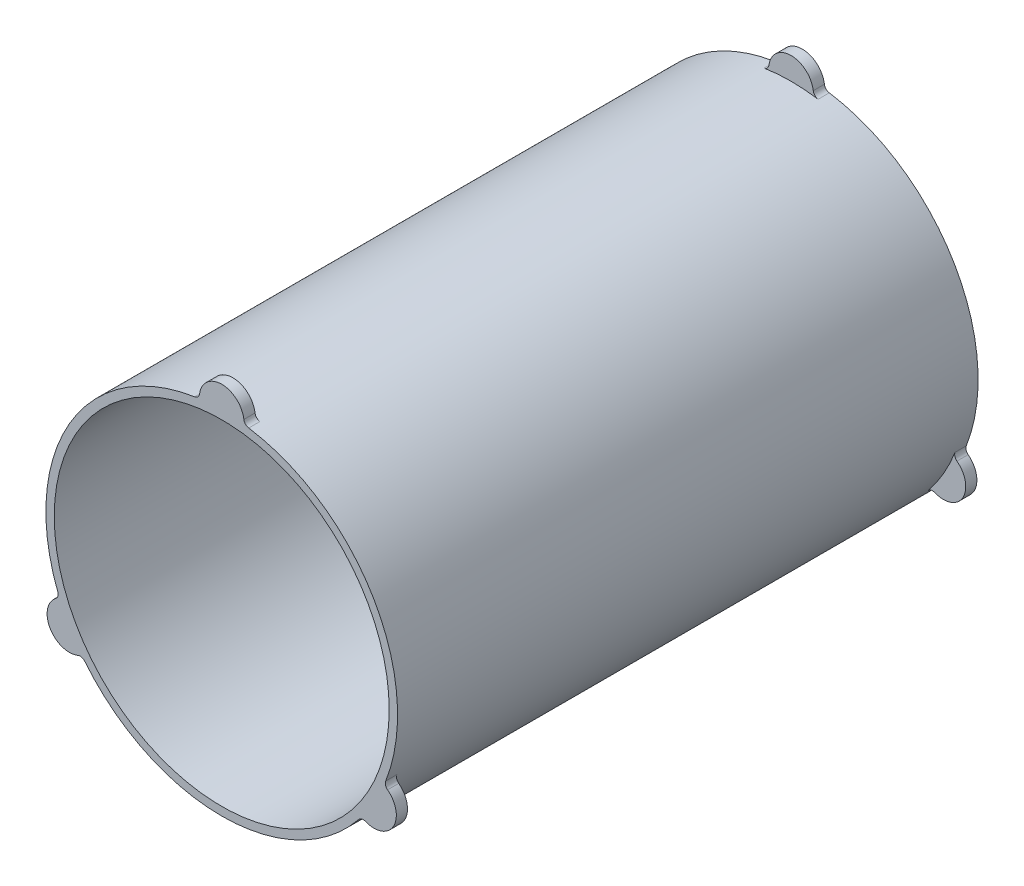
ISO-10303-21;
HEADER;
FILE_DESCRIPTION(('STEP AP214'),'2;1');
FILE_NAME('part.step','',(''),(''),'','','');
FILE_SCHEMA(('AUTOMOTIVE_DESIGN { 1 0 10303 214 1 1 1 1 }'));
ENDSEC;
DATA;
#1=APPLICATION_CONTEXT('core data for automotive mechanical design processes');
#2=APPLICATION_PROTOCOL_DEFINITION('international standard','automotive_design',2000,#1);
#3=PRODUCT_CONTEXT('',#1,'mechanical');
#4=PRODUCT('Part','Part','',(#3));
#5=PRODUCT_RELATED_PRODUCT_CATEGORY('part','',(#4));
#6=PRODUCT_DEFINITION_FORMATION('','',#4);
#7=PRODUCT_DEFINITION_CONTEXT('part definition',#1,'design');
#8=PRODUCT_DEFINITION('design','',#6,#7);
#9=PRODUCT_DEFINITION_SHAPE('','',#8);
#10=(LENGTH_UNIT() NAMED_UNIT(*) SI_UNIT(.MILLI.,.METRE.));
#11=(NAMED_UNIT(*) PLANE_ANGLE_UNIT() SI_UNIT($,.RADIAN.));
#12=(NAMED_UNIT(*) SI_UNIT($,.STERADIAN.) SOLID_ANGLE_UNIT());
#13=UNCERTAINTY_MEASURE_WITH_UNIT(LENGTH_MEASURE(1.E-05),#10,'distance_accuracy_value','');
#14=(GEOMETRIC_REPRESENTATION_CONTEXT(3) GLOBAL_UNCERTAINTY_ASSIGNED_CONTEXT((#13)) GLOBAL_UNIT_ASSIGNED_CONTEXT((#10,
#11,#12)) REPRESENTATION_CONTEXT('',''));
#15=CARTESIAN_POINT('',(0.,0.,0.));
#16=DIRECTION('',(0.,0.,1.));
#17=DIRECTION('',(1.,0.,0.));
#18=AXIS2_PLACEMENT_3D('',#15,#16,#17);
#19=CARTESIAN_POINT('',(0.,0.,165.1));
#20=DIRECTION('',(0.,0.,-1.));
#21=DIRECTION('',(-1.,0.,0.));
#22=AXIS2_PLACEMENT_3D('',#19,#20,#21);
#23=CYLINDRICAL_SURFACE('',#22,100.0125);
#24=CARTESIAN_POINT('',(0.,0.,165.1));
#25=DIRECTION('',(0.,0.,1.));
#26=DIRECTION('',(1.,0.,0.));
#27=AXIS2_PLACEMENT_3D('',#24,#25,#26);
#28=CIRCLE('',#27,100.0125);
#29=CARTESIAN_POINT('',(93.2656496084759,-36.1111999158017,165.1));
#30=VERTEX_POINT('',#29);
#31=CARTESIAN_POINT('',(15.3596083160143,98.8260218192993,165.1));
#32=VERTEX_POINT('',#31);
#33=EDGE_CURVE('E206',#30,#32,#28,.T.);
#34=ORIENTED_EDGE('',*,*,#33,.F.);
#35=DIRECTION('',(0.,0.,-1.));
#36=VECTOR('',#35,1.);
#37=CARTESIAN_POINT('',(93.2656496084759,-36.1111999158017,165.1));
#38=LINE('',#37,#36);
#39=CARTESIAN_POINT('',(93.2656496084759,-36.1111999158017,158.75));
#40=VERTEX_POINT('',#39);
#41=EDGE_CURVE('E274',#30,#40,#38,.T.);
#42=ORIENTED_EDGE('',*,*,#41,.T.);
#43=CARTESIAN_POINT('',(0.,0.,158.75));
#44=DIRECTION('',(0.,0.,-1.));
#45=DIRECTION('',(-0.499999999999992,-0.866025403784443,0.));
#46=AXIS2_PLACEMENT_3D('',#43,#44,#45);
#47=CIRCLE('',#46,100.0125);
#48=CARTESIAN_POINT('',(77.9060412924619,-62.714821903496,158.75));
#49=VERTEX_POINT('',#48);
#50=EDGE_CURVE('E381',#40,#49,#47,.T.);
#51=ORIENTED_EDGE('',*,*,#50,.T.);
#52=DIRECTION('',(0.,0.,-1.));
#53=VECTOR('',#52,1.);
#54=CARTESIAN_POINT('',(77.9060412924619,-62.714821903496,165.1));
#55=LINE('',#54,#53);
#56=CARTESIAN_POINT('',(77.9060412924619,-62.714821903496,165.1));
#57=VERTEX_POINT('',#56);
#58=EDGE_CURVE('E271',#49,#57,#55,.F.);
#59=ORIENTED_EDGE('',*,*,#58,.T.);
#60=CARTESIAN_POINT('',(-77.906041292461,-62.7148219034971,165.1));
#61=VERTEX_POINT('',#60);
#62=EDGE_CURVE('E233',#61,#57,#28,.T.);
#63=ORIENTED_EDGE('',*,*,#62,.F.);
#64=DIRECTION('',(0.,0.,-1.));
#65=VECTOR('',#64,1.);
#66=CARTESIAN_POINT('',(-77.906041292461,-62.7148219034971,165.1));
#67=LINE('',#66,#65);
#68=CARTESIAN_POINT('',(-77.906041292461,-62.7148219034971,158.75));
#69=VERTEX_POINT('',#68);
#70=EDGE_CURVE('E254',#61,#69,#67,.T.);
#71=ORIENTED_EDGE('',*,*,#70,.T.);
#72=CARTESIAN_POINT('',(0.,0.,158.75));
#73=DIRECTION('',(0.,0.,-1.));
#74=DIRECTION('',(-0.500000000000004,0.866025403784436,0.));
#75=AXIS2_PLACEMENT_3D('',#72,#73,#74);
#76=CIRCLE('',#75,100.0125);
#77=CARTESIAN_POINT('',(-93.2656496084754,-36.111199915803,158.75));
#78=VERTEX_POINT('',#77);
#79=EDGE_CURVE('E389',#69,#78,#76,.T.);
#80=ORIENTED_EDGE('',*,*,#79,.T.);
#81=DIRECTION('',(0.,0.,-1.));
#82=VECTOR('',#81,1.);
#83=CARTESIAN_POINT('',(-93.2656496084754,-36.111199915803,165.1));
#84=LINE('',#83,#82);
#85=CARTESIAN_POINT('',(-93.2656496084754,-36.111199915803,165.1));
#86=VERTEX_POINT('',#85);
#87=EDGE_CURVE('E251',#78,#86,#84,.F.);
#88=ORIENTED_EDGE('',*,*,#87,.T.);
#89=CARTESIAN_POINT('',(-15.3596083160142,98.8260218192993,165.1));
#90=VERTEX_POINT('',#89);
#91=EDGE_CURVE('E228',#90,#86,#28,.T.);
#92=ORIENTED_EDGE('',*,*,#91,.F.);
#93=DIRECTION('',(0.,0.,-1.));
#94=VECTOR('',#93,1.);
#95=CARTESIAN_POINT('',(-15.3596083160143,98.8260218192993,165.1));
#96=LINE('',#95,#94);
#97=CARTESIAN_POINT('',(-15.3596083160143,98.8260218192994,158.75));
#98=VERTEX_POINT('',#97);
#99=EDGE_CURVE('E239',#90,#98,#96,.T.);
#100=ORIENTED_EDGE('',*,*,#99,.T.);
#101=CARTESIAN_POINT('',(0.,0.,158.75));
#102=DIRECTION('',(0.,0.,-1.));
#103=DIRECTION('',(1.,0.,0.));
#104=AXIS2_PLACEMENT_3D('',#101,#102,#103);
#105=CIRCLE('',#104,100.0125);
#106=CARTESIAN_POINT('',(15.3596083160143,98.8260218192994,158.75));
#107=VERTEX_POINT('',#106);
#108=EDGE_CURVE('E222',#98,#107,#105,.T.);
#109=ORIENTED_EDGE('',*,*,#108,.T.);
#110=DIRECTION('',(0.,0.,-1.));
#111=VECTOR('',#110,1.);
#112=CARTESIAN_POINT('',(15.3596083160143,98.8260218192993,165.1));
#113=LINE('',#112,#111);
#114=EDGE_CURVE('E230',#107,#32,#113,.F.);
#115=ORIENTED_EDGE('',*,*,#114,.T.);
#116=EDGE_LOOP('',(#34,#42,#51,#59,#63,#71,#80,#88,#92,#100,#109,#115));
#117=FACE_BOUND('',#116,.T.);
#118=CARTESIAN_POINT('',(0.,0.,-165.1));
#119=DIRECTION('',(0.,0.,1.));
#120=DIRECTION('',(1.,0.,0.));
#121=AXIS2_PLACEMENT_3D('',#118,#119,#120);
#122=CIRCLE('',#121,100.0125);
#123=CARTESIAN_POINT('',(-77.906041292461,-62.7148219034971,-165.1));
#124=VERTEX_POINT('',#123);
#125=CARTESIAN_POINT('',(77.9060412924619,-62.714821903496,-165.1));
#126=VERTEX_POINT('',#125);
#127=EDGE_CURVE('E473',#124,#126,#122,.T.);
#128=ORIENTED_EDGE('',*,*,#127,.T.);
#129=DIRECTION('',(0.,0.,-1.));
#130=VECTOR('',#129,1.);
#131=CARTESIAN_POINT('',(77.9060412924619,-62.714821903496,165.1));
#132=LINE('',#131,#130);
#133=CARTESIAN_POINT('',(77.9060412924619,-62.714821903496,-158.75));
#134=VERTEX_POINT('',#133);
#135=EDGE_CURVE('E334',#126,#134,#132,.F.);
#136=ORIENTED_EDGE('',*,*,#135,.T.);
#137=CARTESIAN_POINT('',(0.,0.,-158.75));
#138=DIRECTION('',(0.,0.,-1.));
#139=DIRECTION('',(-0.499999999999992,-0.866025403784443,0.));
#140=AXIS2_PLACEMENT_3D('',#137,#138,#139);
#141=CIRCLE('',#140,100.0125);
#142=CARTESIAN_POINT('',(93.2656496084759,-36.1111999158017,-158.75));
#143=VERTEX_POINT('',#142);
#144=EDGE_CURVE('E56',#143,#134,#141,.T.);
#145=ORIENTED_EDGE('',*,*,#144,.F.);
#146=DIRECTION('',(0.,0.,-1.));
#147=VECTOR('',#146,1.);
#148=CARTESIAN_POINT('',(93.2656496084759,-36.1111999158017,165.1));
#149=LINE('',#148,#147);
#150=CARTESIAN_POINT('',(93.2656496084759,-36.1111999158017,-165.1));
#151=VERTEX_POINT('',#150);
#152=EDGE_CURVE('E332',#143,#151,#149,.T.);
#153=ORIENTED_EDGE('',*,*,#152,.T.);
#154=CARTESIAN_POINT('',(15.3596083160143,98.8260218192993,-165.1));
#155=VERTEX_POINT('',#154);
#156=EDGE_CURVE('E347',#151,#155,#122,.T.);
#157=ORIENTED_EDGE('',*,*,#156,.T.);
#158=DIRECTION('',(0.,0.,-1.));
#159=VECTOR('',#158,1.);
#160=CARTESIAN_POINT('',(15.3596083160143,98.8260218192993,165.1));
#161=LINE('',#160,#159);
#162=CARTESIAN_POINT('',(15.3596083160143,98.8260218192994,-158.75));
#163=VERTEX_POINT('',#162);
#164=EDGE_CURVE('E294',#155,#163,#161,.F.);
#165=ORIENTED_EDGE('',*,*,#164,.T.);
#166=CARTESIAN_POINT('',(0.,0.,-158.75));
#167=DIRECTION('',(0.,0.,-1.));
#168=DIRECTION('',(1.,0.,0.));
#169=AXIS2_PLACEMENT_3D('',#166,#167,#168);
#170=CIRCLE('',#169,100.0125);
#171=CARTESIAN_POINT('',(-15.3596083160143,98.8260218192994,-158.75));
#172=VERTEX_POINT('',#171);
#173=EDGE_CURVE('E373',#172,#163,#170,.T.);
#174=ORIENTED_EDGE('',*,*,#173,.F.);
#175=DIRECTION('',(0.,0.,-1.));
#176=VECTOR('',#175,1.);
#177=CARTESIAN_POINT('',(-15.3596083160143,98.8260218192993,165.1));
#178=LINE('',#177,#176);
#179=CARTESIAN_POINT('',(-15.3596083160143,98.8260218192993,-165.1));
#180=VERTEX_POINT('',#179);
#181=EDGE_CURVE('E291',#172,#180,#178,.T.);
#182=ORIENTED_EDGE('',*,*,#181,.T.);
#183=CARTESIAN_POINT('',(-93.2656496084754,-36.111199915803,-165.1));
#184=VERTEX_POINT('',#183);
#185=EDGE_CURVE('E236',#180,#184,#122,.T.);
#186=ORIENTED_EDGE('',*,*,#185,.T.);
#187=DIRECTION('',(0.,0.,-1.));
#188=VECTOR('',#187,1.);
#189=CARTESIAN_POINT('',(-93.2656496084754,-36.111199915803,165.1));
#190=LINE('',#189,#188);
#191=CARTESIAN_POINT('',(-93.2656496084754,-36.111199915803,-158.75));
#192=VERTEX_POINT('',#191);
#193=EDGE_CURVE('E315',#184,#192,#190,.F.);
#194=ORIENTED_EDGE('',*,*,#193,.T.);
#195=CARTESIAN_POINT('',(0.,0.,-158.75));
#196=DIRECTION('',(0.,0.,-1.));
#197=DIRECTION('',(-0.500000000000004,0.866025403784436,0.));
#198=AXIS2_PLACEMENT_3D('',#195,#196,#197);
#199=CIRCLE('',#198,100.0125);
#200=CARTESIAN_POINT('',(-77.906041292461,-62.7148219034971,-158.75));
#201=VERTEX_POINT('',#200);
#202=EDGE_CURVE('E364',#201,#192,#199,.T.);
#203=ORIENTED_EDGE('',*,*,#202,.F.);
#204=DIRECTION('',(0.,0.,-1.));
#205=VECTOR('',#204,1.);
#206=CARTESIAN_POINT('',(-77.906041292461,-62.7148219034971,165.1));
#207=LINE('',#206,#205);
#208=EDGE_CURVE('E312',#201,#124,#207,.T.);
#209=ORIENTED_EDGE('',*,*,#208,.T.);
#210=EDGE_LOOP('',(#128,#136,#145,#153,#157,#165,#174,#182,#186,#194,#203,#209));
#211=FACE_BOUND('',#210,.T.);
#212=ADVANCED_FACE('F42',(#117,#211),#23,.T.);
#213=CARTESIAN_POINT('',(0.,0.,165.1));
#214=DIRECTION('',(0.,0.,1.));
#215=DIRECTION('',(1.,0.,0.));
#216=AXIS2_PLACEMENT_3D('',#213,#214,#215);
#217=PLANE('',#216);
#218=CARTESIAN_POINT('',(0.,100.0125,165.1));
#219=DIRECTION('',(0.,0.,1.));
#220=DIRECTION('',(-1.,0.,0.));
#221=AXIS2_PLACEMENT_3D('',#218,#219,#220);
#222=CIRCLE('',#221,12.7);
#223=CARTESIAN_POINT('',(12.5926342807534,101.660396195515,165.1));
#224=VERTEX_POINT('',#223);
#225=CARTESIAN_POINT('',(-12.5926342807534,101.660396195515,165.1));
#226=VERTEX_POINT('',#225);
#227=EDGE_CURVE('E204',#224,#226,#222,.T.);
#228=ORIENTED_EDGE('',*,*,#227,.T.);
#229=CARTESIAN_POINT('',(-15.8667191937493,102.088849206349,165.1));
#230=DIRECTION('',(0.,0.,1.));
#231=DIRECTION('',(1.,0.,0.));
#232=AXIS2_PLACEMENT_3D('',#229,#230,#231);
#233=CIRCLE('',#232,3.302);
#234=EDGE_CURVE('E242',#226,#90,#233,.F.);
#235=ORIENTED_EDGE('',*,*,#234,.T.);
#236=ORIENTED_EDGE('',*,*,#91,.T.);
#237=CARTESIAN_POINT('',(-96.3448964526918,-37.303442706674,165.1));
#238=DIRECTION('',(0.,0.,1.));
#239=DIRECTION('',(1.,0.,0.));
#240=AXIS2_PLACEMENT_3D('',#237,#238,#239);
#241=CIRCLE('',#240,3.302);
#242=CARTESIAN_POINT('',(-94.3368028044836,-39.9246569100588,165.1));
#243=VERTEX_POINT('',#242);
#244=EDGE_CURVE('E261',#86,#243,#241,.F.);
#245=ORIENTED_EDGE('',*,*,#244,.T.);
#246=CARTESIAN_POINT('',(-86.613365695991,-50.0062500000004,165.1));
#247=DIRECTION('',(0.,0.,1.));
#248=DIRECTION('',(0.500000000000004,-0.866025403784436,0.));
#249=AXIS2_PLACEMENT_3D('',#246,#247,#248);
#250=CIRCLE('',#249,12.7);
#251=CARTESIAN_POINT('',(-81.7441685237301,-61.7357392854573,165.1));
#252=VERTEX_POINT('',#251);
#253=EDGE_CURVE('E386',#243,#252,#250,.T.);
#254=ORIENTED_EDGE('',*,*,#253,.T.);
#255=CARTESIAN_POINT('',(-80.4781772589423,-64.785406499676,165.1));
#256=DIRECTION('',(0.,0.,1.));
#257=DIRECTION('',(1.,0.,0.));
#258=AXIS2_PLACEMENT_3D('',#255,#256,#257);
#259=CIRCLE('',#258,3.302);
#260=EDGE_CURVE('E257',#252,#61,#259,.F.);
#261=ORIENTED_EDGE('',*,*,#260,.T.);
#262=ORIENTED_EDGE('',*,*,#62,.T.);
#263=CARTESIAN_POINT('',(80.4781772589432,-64.785406499675,165.1));
#264=DIRECTION('',(0.,0.,1.));
#265=DIRECTION('',(1.,0.,0.));
#266=AXIS2_PLACEMENT_3D('',#263,#264,#265);
#267=CIRCLE('',#266,3.302);
#268=CARTESIAN_POINT('',(81.744168523731,-61.7357392854561,165.1));
#269=VERTEX_POINT('',#268);
#270=EDGE_CURVE('E281',#57,#269,#267,.F.);
#271=ORIENTED_EDGE('',*,*,#270,.T.);
#272=CARTESIAN_POINT('',(86.6133656959916,-50.0062499999992,165.1));
#273=DIRECTION('',(0.,0.,1.));
#274=DIRECTION('',(0.499999999999992,0.866025403784443,0.));
#275=AXIS2_PLACEMENT_3D('',#272,#273,#274);
#276=CIRCLE('',#275,12.7);
#277=CARTESIAN_POINT('',(94.3368028044842,-39.9246569100575,165.1));
#278=VERTEX_POINT('',#277);
#279=EDGE_CURVE('E378',#269,#278,#276,.T.);
#280=ORIENTED_EDGE('',*,*,#279,.T.);
#281=CARTESIAN_POINT('',(96.3448964526923,-37.3034427066727,165.1));
#282=DIRECTION('',(0.,0.,1.));
#283=DIRECTION('',(1.,0.,0.));
#284=AXIS2_PLACEMENT_3D('',#281,#282,#283);
#285=CIRCLE('',#284,3.302);
#286=EDGE_CURVE('E277',#278,#30,#285,.F.);
#287=ORIENTED_EDGE('',*,*,#286,.T.);
#288=ORIENTED_EDGE('',*,*,#33,.T.);
#289=CARTESIAN_POINT('',(15.8667191937494,102.088849206349,165.1));
#290=DIRECTION('',(0.,0.,1.));
#291=DIRECTION('',(1.,0.,0.));
#292=AXIS2_PLACEMENT_3D('',#289,#290,#291);
#293=CIRCLE('',#292,3.302);
#294=EDGE_CURVE('E200',#32,#224,#293,.F.);
#295=ORIENTED_EDGE('',*,*,#294,.T.);
#296=EDGE_LOOP('',(#228,#235,#236,#245,#254,#261,#262,#271,#280,#287,#288,#295));
#297=FACE_BOUND('',#296,.T.);
#298=CARTESIAN_POINT('',(0.,0.,165.1));
#299=DIRECTION('',(0.,0.,1.));
#300=DIRECTION('',(1.,0.,0.));
#301=AXIS2_PLACEMENT_3D('',#298,#299,#300);
#302=CIRCLE('',#301,95.25);
#303=CARTESIAN_POINT('',(95.25,0.,165.1));
#304=VERTEX_POINT('',#303);
#305=EDGE_CURVE('E399',#304,#304,#302,.T.);
#306=ORIENTED_EDGE('',*,*,#305,.F.);
#307=EDGE_LOOP('',(#306));
#308=FACE_BOUND('',#307,.T.);
#309=ADVANCED_FACE('F202',(#297,#308),#217,.T.);
#310=CARTESIAN_POINT('',(0.,0.,-165.1));
#311=DIRECTION('',(0.,0.,1.));
#312=DIRECTION('',(1.,0.,0.));
#313=AXIS2_PLACEMENT_3D('',#310,#311,#312);
#314=PLANE('',#313);
#315=ORIENTED_EDGE('',*,*,#185,.F.);
#316=CARTESIAN_POINT('',(-15.8667191937494,102.088849206349,-165.1));
#317=DIRECTION('',(0.,0.,1.));
#318=DIRECTION('',(1.,0.,0.));
#319=AXIS2_PLACEMENT_3D('',#316,#317,#318);
#320=CIRCLE('',#319,3.302);
#321=CARTESIAN_POINT('',(-12.5926342807534,101.660396195515,-165.1));
#322=VERTEX_POINT('',#321);
#323=EDGE_CURVE('E302',#180,#322,#320,.T.);
#324=ORIENTED_EDGE('',*,*,#323,.T.);
#325=CARTESIAN_POINT('',(0.,100.0125,-165.1));
#326=DIRECTION('',(0.,0.,1.));
#327=DIRECTION('',(-1.,0.,0.));
#328=AXIS2_PLACEMENT_3D('',#325,#326,#327);
#329=CIRCLE('',#328,12.7);
#330=CARTESIAN_POINT('',(12.5926342807534,101.660396195515,-165.1));
#331=VERTEX_POINT('',#330);
#332=EDGE_CURVE('E371',#331,#322,#329,.T.);
#333=ORIENTED_EDGE('',*,*,#332,.F.);
#334=CARTESIAN_POINT('',(15.8667191937493,102.088849206349,-165.1));
#335=DIRECTION('',(0.,0.,1.));
#336=DIRECTION('',(1.,0.,0.));
#337=AXIS2_PLACEMENT_3D('',#334,#335,#336);
#338=CIRCLE('',#337,3.302);
#339=EDGE_CURVE('E297',#331,#155,#338,.T.);
#340=ORIENTED_EDGE('',*,*,#339,.T.);
#341=ORIENTED_EDGE('',*,*,#156,.F.);
#342=CARTESIAN_POINT('',(96.3448964526923,-37.3034427066726,-165.1));
#343=DIRECTION('',(0.,0.,1.));
#344=DIRECTION('',(1.,0.,0.));
#345=AXIS2_PLACEMENT_3D('',#342,#343,#344);
#346=CIRCLE('',#345,3.302);
#347=CARTESIAN_POINT('',(94.3368028044842,-39.9246569100575,-165.1));
#348=VERTEX_POINT('',#347);
#349=EDGE_CURVE('E50',#151,#348,#346,.T.);
#350=ORIENTED_EDGE('',*,*,#349,.T.);
#351=CARTESIAN_POINT('',(86.6133656959916,-50.0062499999992,-165.1));
#352=DIRECTION('',(0.,0.,1.));
#353=DIRECTION('',(0.499999999999992,0.866025403784443,0.));
#354=AXIS2_PLACEMENT_3D('',#351,#352,#353);
#355=CIRCLE('',#354,12.7);
#356=CARTESIAN_POINT('',(81.7441685237309,-61.7357392854561,-165.1));
#357=VERTEX_POINT('',#356);
#358=EDGE_CURVE('E346',#357,#348,#355,.T.);
#359=ORIENTED_EDGE('',*,*,#358,.F.);
#360=CARTESIAN_POINT('',(80.4781772589432,-64.7854064996749,-165.1));
#361=DIRECTION('',(0.,0.,1.));
#362=DIRECTION('',(1.,0.,0.));
#363=AXIS2_PLACEMENT_3D('',#360,#361,#362);
#364=CIRCLE('',#363,3.302);
#365=EDGE_CURVE('E336',#357,#126,#364,.T.);
#366=ORIENTED_EDGE('',*,*,#365,.T.);
#367=ORIENTED_EDGE('',*,*,#127,.F.);
#368=CARTESIAN_POINT('',(-80.4781772589423,-64.7854064996761,-165.1));
#369=DIRECTION('',(0.,0.,1.));
#370=DIRECTION('',(1.,0.,0.));
#371=AXIS2_PLACEMENT_3D('',#368,#369,#370);
#372=CIRCLE('',#371,3.302);
#373=CARTESIAN_POINT('',(-81.7441685237301,-61.7357392854573,-165.1));
#374=VERTEX_POINT('',#373);
#375=EDGE_CURVE('E322',#124,#374,#372,.T.);
#376=ORIENTED_EDGE('',*,*,#375,.T.);
#377=CARTESIAN_POINT('',(-86.613365695991,-50.0062500000004,-165.1));
#378=DIRECTION('',(0.,0.,1.));
#379=DIRECTION('',(0.500000000000004,-0.866025403784436,0.));
#380=AXIS2_PLACEMENT_3D('',#377,#378,#379);
#381=CIRCLE('',#380,12.7);
#382=CARTESIAN_POINT('',(-94.3368028044836,-39.9246569100588,-165.1));
#383=VERTEX_POINT('',#382);
#384=EDGE_CURVE('E361',#383,#374,#381,.T.);
#385=ORIENTED_EDGE('',*,*,#384,.F.);
#386=CARTESIAN_POINT('',(-96.3448964526917,-37.303442706674,-165.1));
#387=DIRECTION('',(0.,0.,1.));
#388=DIRECTION('',(1.,0.,0.));
#389=AXIS2_PLACEMENT_3D('',#386,#387,#388);
#390=CIRCLE('',#389,3.302);
#391=EDGE_CURVE('E318',#383,#184,#390,.T.);
#392=ORIENTED_EDGE('',*,*,#391,.T.);
#393=EDGE_LOOP('',(#315,#324,#333,#340,#341,#350,#359,#366,#367,#376,#385,#392));
#394=FACE_BOUND('',#393,.T.);
#395=CARTESIAN_POINT('',(0.,0.,-165.1));
#396=DIRECTION('',(0.,0.,1.));
#397=DIRECTION('',(1.,0.,0.));
#398=AXIS2_PLACEMENT_3D('',#395,#396,#397);
#399=CIRCLE('',#398,95.25);
#400=CARTESIAN_POINT('',(95.25,0.,-165.1));
#401=VERTEX_POINT('',#400);
#402=EDGE_CURVE('E397',#401,#401,#399,.T.);
#403=ORIENTED_EDGE('',*,*,#402,.T.);
#404=EDGE_LOOP('',(#403));
#405=FACE_BOUND('',#404,.T.);
#406=ADVANCED_FACE('F344',(#394,#405),#314,.F.);
#407=CARTESIAN_POINT('',(0.,0.,165.1));
#408=DIRECTION('',(0.,0.,-1.));
#409=DIRECTION('',(-1.,0.,0.));
#410=AXIS2_PLACEMENT_3D('',#407,#408,#409);
#411=CYLINDRICAL_SURFACE('',#410,95.25);
#412=ORIENTED_EDGE('',*,*,#305,.T.);
#413=EDGE_LOOP('',(#412));
#414=FACE_BOUND('',#413,.T.);
#415=ORIENTED_EDGE('',*,*,#402,.F.);
#416=EDGE_LOOP('',(#415));
#417=FACE_BOUND('',#416,.T.);
#418=ADVANCED_FACE('F405',(#414,#417),#411,.F.);
#419=CARTESIAN_POINT('',(0.,100.0125,158.75));
#420=DIRECTION('',(0.,0.,1.));
#421=DIRECTION('',(1.,0.,0.));
#422=AXIS2_PLACEMENT_3D('',#419,#420,#421);
#423=CYLINDRICAL_SURFACE('',#422,12.7);
#424=CARTESIAN_POINT('',(0.,100.0125,158.75));
#425=DIRECTION('',(0.,0.,1.));
#426=DIRECTION('',(-1.,0.,0.));
#427=AXIS2_PLACEMENT_3D('',#424,#425,#426);
#428=CIRCLE('',#427,12.7);
#429=CARTESIAN_POINT('',(12.5926342807534,101.660396195515,158.75));
#430=VERTEX_POINT('',#429);
#431=CARTESIAN_POINT('',(-12.5926342807534,101.660396195515,158.75));
#432=VERTEX_POINT('',#431);
#433=EDGE_CURVE('E396',#430,#432,#428,.T.);
#434=ORIENTED_EDGE('',*,*,#433,.T.);
#435=DIRECTION('',(0.,0.,1.));
#436=VECTOR('',#435,1.);
#437=CARTESIAN_POINT('',(-12.5926342807534,101.660396195515,158.75));
#438=LINE('',#437,#436);
#439=EDGE_CURVE('E221',#432,#226,#438,.T.);
#440=ORIENTED_EDGE('',*,*,#439,.T.);
#441=ORIENTED_EDGE('',*,*,#227,.F.);
#442=DIRECTION('',(0.,0.,1.));
#443=VECTOR('',#442,1.);
#444=CARTESIAN_POINT('',(12.5926342807534,101.660396195515,158.75));
#445=LINE('',#444,#443);
#446=EDGE_CURVE('E218',#224,#430,#445,.F.);
#447=ORIENTED_EDGE('',*,*,#446,.T.);
#448=EDGE_LOOP('',(#434,#440,#441,#447));
#449=FACE_BOUND('',#448,.T.);
#450=ADVANCED_FACE('F217',(#449),#423,.T.);
#451=CARTESIAN_POINT('',(0.,50.00625,158.75));
#452=DIRECTION('',(0.,0.,1.));
#453=DIRECTION('',(1.,0.,0.));
#454=AXIS2_PLACEMENT_3D('',#451,#452,#453);
#455=PLANE('',#454);
#456=ORIENTED_EDGE('',*,*,#108,.F.);
#457=CARTESIAN_POINT('',(-15.8667191937493,102.088849206349,158.75));
#458=DIRECTION('',(0.,0.,1.));
#459=DIRECTION('',(1.,0.,0.));
#460=AXIS2_PLACEMENT_3D('',#457,#458,#459);
#461=CIRCLE('',#460,3.302);
#462=EDGE_CURVE('E212',#98,#432,#461,.T.);
#463=ORIENTED_EDGE('',*,*,#462,.T.);
#464=ORIENTED_EDGE('',*,*,#433,.F.);
#465=CARTESIAN_POINT('',(15.8667191937494,102.088849206349,158.75));
#466=DIRECTION('',(0.,0.,1.));
#467=DIRECTION('',(1.,0.,0.));
#468=AXIS2_PLACEMENT_3D('',#465,#466,#467);
#469=CIRCLE('',#468,3.302);
#470=EDGE_CURVE('E211',#430,#107,#469,.T.);
#471=ORIENTED_EDGE('',*,*,#470,.T.);
#472=EDGE_LOOP('',(#456,#463,#464,#471));
#473=FACE_BOUND('',#472,.T.);
#474=ADVANCED_FACE('F413',(#473),#455,.F.);
#475=CARTESIAN_POINT('',(-15.8667191937493,102.088849206349,165.1));
#476=DIRECTION('',(0.,0.,-1.));
#477=DIRECTION('',(-1.,0.,0.));
#478=AXIS2_PLACEMENT_3D('',#475,#476,#477);
#479=CYLINDRICAL_SURFACE('',#478,3.302);
#480=ORIENTED_EDGE('',*,*,#462,.F.);
#481=ORIENTED_EDGE('',*,*,#99,.F.);
#482=ORIENTED_EDGE('',*,*,#234,.F.);
#483=ORIENTED_EDGE('',*,*,#439,.F.);
#484=EDGE_LOOP('',(#480,#481,#482,#483));
#485=FACE_BOUND('',#484,.T.);
#486=ADVANCED_FACE('F424',(#485),#479,.F.);
#487=CARTESIAN_POINT('',(15.8667191937494,102.088849206349,158.75));
#488=DIRECTION('',(0.,0.,-1.));
#489=DIRECTION('',(-1.,0.,0.));
#490=AXIS2_PLACEMENT_3D('',#487,#488,#489);
#491=CYLINDRICAL_SURFACE('',#490,3.302);
#492=ORIENTED_EDGE('',*,*,#470,.F.);
#493=ORIENTED_EDGE('',*,*,#446,.F.);
#494=ORIENTED_EDGE('',*,*,#294,.F.);
#495=ORIENTED_EDGE('',*,*,#114,.F.);
#496=EDGE_LOOP('',(#492,#493,#494,#495));
#497=FACE_BOUND('',#496,.T.);
#498=ADVANCED_FACE('F226',(#497),#491,.F.);
#499=CARTESIAN_POINT('',(-86.613365695991,-50.0062500000004,158.75));
#500=DIRECTION('',(0.,0.,1.));
#501=DIRECTION('',(1.,0.,0.));
#502=AXIS2_PLACEMENT_3D('',#499,#500,#501);
#503=CYLINDRICAL_SURFACE('',#502,12.7);
#504=CARTESIAN_POINT('',(-86.613365695991,-50.0062500000004,158.75));
#505=DIRECTION('',(0.,0.,1.));
#506=DIRECTION('',(0.500000000000004,-0.866025403784436,0.));
#507=AXIS2_PLACEMENT_3D('',#504,#505,#506);
#508=CIRCLE('',#507,12.7);
#509=CARTESIAN_POINT('',(-94.3368028044836,-39.9246569100588,158.75));
#510=VERTEX_POINT('',#509);
#511=CARTESIAN_POINT('',(-81.7441685237301,-61.7357392854573,158.75));
#512=VERTEX_POINT('',#511);
#513=EDGE_CURVE('E223',#510,#512,#508,.T.);
#514=ORIENTED_EDGE('',*,*,#513,.T.);
#515=DIRECTION('',(0.,0.,1.));
#516=VECTOR('',#515,1.);
#517=CARTESIAN_POINT('',(-81.7441685237301,-61.7357392854573,158.75));
#518=LINE('',#517,#516);
#519=EDGE_CURVE('E248',#512,#252,#518,.T.);
#520=ORIENTED_EDGE('',*,*,#519,.T.);
#521=ORIENTED_EDGE('',*,*,#253,.F.);
#522=DIRECTION('',(0.,0.,1.));
#523=VECTOR('',#522,1.);
#524=CARTESIAN_POINT('',(-94.3368028044836,-39.9246569100588,158.75));
#525=LINE('',#524,#523);
#526=EDGE_CURVE('E246',#243,#510,#525,.F.);
#527=ORIENTED_EDGE('',*,*,#526,.T.);
#528=EDGE_LOOP('',(#514,#520,#521,#527));
#529=FACE_BOUND('',#528,.T.);
#530=ADVANCED_FACE('F430',(#529),#503,.T.);
#531=CARTESIAN_POINT('',(-43.3066828479955,-25.0031250000002,158.75));
#532=DIRECTION('',(0.,0.,1.));
#533=DIRECTION('',(-0.500000000000004,0.866025403784436,0.));
#534=AXIS2_PLACEMENT_3D('',#531,#532,#533);
#535=PLANE('',#534);
#536=ORIENTED_EDGE('',*,*,#79,.F.);
#537=CARTESIAN_POINT('',(-80.4781772589423,-64.785406499676,158.75));
#538=DIRECTION('',(0.,0.,1.));
#539=DIRECTION('',(1.,0.,0.));
#540=AXIS2_PLACEMENT_3D('',#537,#538,#539);
#541=CIRCLE('',#540,3.302);
#542=EDGE_CURVE('E259',#69,#512,#541,.T.);
#543=ORIENTED_EDGE('',*,*,#542,.T.);
#544=ORIENTED_EDGE('',*,*,#513,.F.);
#545=CARTESIAN_POINT('',(-96.3448964526918,-37.303442706674,158.75));
#546=DIRECTION('',(0.,0.,1.));
#547=DIRECTION('',(1.,0.,0.));
#548=AXIS2_PLACEMENT_3D('',#545,#546,#547);
#549=CIRCLE('',#548,3.302);
#550=EDGE_CURVE('E263',#510,#78,#549,.T.);
#551=ORIENTED_EDGE('',*,*,#550,.T.);
#552=EDGE_LOOP('',(#536,#543,#544,#551));
#553=FACE_BOUND('',#552,.T.);
#554=ADVANCED_FACE('F518',(#553),#535,.F.);
#555=CARTESIAN_POINT('',(86.6133656959916,-50.0062499999992,158.75));
#556=DIRECTION('',(0.,0.,1.));
#557=DIRECTION('',(1.,0.,0.));
#558=AXIS2_PLACEMENT_3D('',#555,#556,#557);
#559=CYLINDRICAL_SURFACE('',#558,12.7);
#560=CARTESIAN_POINT('',(86.6133656959916,-50.0062499999992,158.75));
#561=DIRECTION('',(0.,0.,1.));
#562=DIRECTION('',(0.499999999999992,0.866025403784443,0.));
#563=AXIS2_PLACEMENT_3D('',#560,#561,#562);
#564=CIRCLE('',#563,12.7);
#565=CARTESIAN_POINT('',(81.744168523731,-61.7357392854561,158.75));
#566=VERTEX_POINT('',#565);
#567=CARTESIAN_POINT('',(94.3368028044842,-39.9246569100575,158.75));
#568=VERTEX_POINT('',#567);
#569=EDGE_CURVE('E383',#566,#568,#564,.T.);
#570=ORIENTED_EDGE('',*,*,#569,.T.);
#571=DIRECTION('',(0.,0.,1.));
#572=VECTOR('',#571,1.);
#573=CARTESIAN_POINT('',(94.3368028044842,-39.9246569100575,158.75));
#574=LINE('',#573,#572);
#575=EDGE_CURVE('E268',#568,#278,#574,.T.);
#576=ORIENTED_EDGE('',*,*,#575,.T.);
#577=ORIENTED_EDGE('',*,*,#279,.F.);
#578=DIRECTION('',(0.,0.,1.));
#579=VECTOR('',#578,1.);
#580=CARTESIAN_POINT('',(81.744168523731,-61.7357392854561,158.75));
#581=LINE('',#580,#579);
#582=EDGE_CURVE('E266',#269,#566,#581,.F.);
#583=ORIENTED_EDGE('',*,*,#582,.T.);
#584=EDGE_LOOP('',(#570,#576,#577,#583));
#585=FACE_BOUND('',#584,.T.);
#586=ADVANCED_FACE('F514',(#585),#559,.T.);
#587=CARTESIAN_POINT('',(43.3066828479958,-25.0031249999996,158.75));
#588=DIRECTION('',(0.,0.,1.));
#589=DIRECTION('',(-0.499999999999992,-0.866025403784443,0.));
#590=AXIS2_PLACEMENT_3D('',#587,#588,#589);
#591=PLANE('',#590);
#592=ORIENTED_EDGE('',*,*,#50,.F.);
#593=CARTESIAN_POINT('',(96.3448964526923,-37.3034427066727,158.75));
#594=DIRECTION('',(0.,0.,1.));
#595=DIRECTION('',(1.,0.,0.));
#596=AXIS2_PLACEMENT_3D('',#593,#594,#595);
#597=CIRCLE('',#596,3.302);
#598=EDGE_CURVE('E279',#40,#568,#597,.T.);
#599=ORIENTED_EDGE('',*,*,#598,.T.);
#600=ORIENTED_EDGE('',*,*,#569,.F.);
#601=CARTESIAN_POINT('',(80.4781772589432,-64.785406499675,158.75));
#602=DIRECTION('',(0.,0.,1.));
#603=DIRECTION('',(1.,0.,0.));
#604=AXIS2_PLACEMENT_3D('',#601,#602,#603);
#605=CIRCLE('',#604,3.302);
#606=EDGE_CURVE('E283',#566,#49,#605,.T.);
#607=ORIENTED_EDGE('',*,*,#606,.T.);
#608=EDGE_LOOP('',(#592,#599,#600,#607));
#609=FACE_BOUND('',#608,.T.);
#610=ADVANCED_FACE('F435',(#609),#591,.F.);
#611=CARTESIAN_POINT('',(-80.4781772589423,-64.785406499676,165.1));
#612=DIRECTION('',(0.,0.,-1.));
#613=DIRECTION('',(-1.,0.,0.));
#614=AXIS2_PLACEMENT_3D('',#611,#612,#613);
#615=CYLINDRICAL_SURFACE('',#614,3.302);
#616=ORIENTED_EDGE('',*,*,#542,.F.);
#617=ORIENTED_EDGE('',*,*,#70,.F.);
#618=ORIENTED_EDGE('',*,*,#260,.F.);
#619=ORIENTED_EDGE('',*,*,#519,.F.);
#620=EDGE_LOOP('',(#616,#617,#618,#619));
#621=FACE_BOUND('',#620,.T.);
#622=ADVANCED_FACE('F431',(#621),#615,.F.);
#623=CARTESIAN_POINT('',(-96.3448964526918,-37.303442706674,158.75));
#624=DIRECTION('',(0.,0.,-1.));
#625=DIRECTION('',(-1.,0.,0.));
#626=AXIS2_PLACEMENT_3D('',#623,#624,#625);
#627=CYLINDRICAL_SURFACE('',#626,3.302);
#628=ORIENTED_EDGE('',*,*,#550,.F.);
#629=ORIENTED_EDGE('',*,*,#526,.F.);
#630=ORIENTED_EDGE('',*,*,#244,.F.);
#631=ORIENTED_EDGE('',*,*,#87,.F.);
#632=EDGE_LOOP('',(#628,#629,#630,#631));
#633=FACE_BOUND('',#632,.T.);
#634=ADVANCED_FACE('F434',(#633),#627,.F.);
#635=CARTESIAN_POINT('',(96.3448964526923,-37.3034427066727,165.1));
#636=DIRECTION('',(0.,0.,-1.));
#637=DIRECTION('',(-1.,0.,0.));
#638=AXIS2_PLACEMENT_3D('',#635,#636,#637);
#639=CYLINDRICAL_SURFACE('',#638,3.302);
#640=ORIENTED_EDGE('',*,*,#598,.F.);
#641=ORIENTED_EDGE('',*,*,#41,.F.);
#642=ORIENTED_EDGE('',*,*,#286,.F.);
#643=ORIENTED_EDGE('',*,*,#575,.F.);
#644=EDGE_LOOP('',(#640,#641,#642,#643));
#645=FACE_BOUND('',#644,.T.);
#646=ADVANCED_FACE('F439',(#645),#639,.F.);
#647=CARTESIAN_POINT('',(80.4781772589432,-64.785406499675,158.75));
#648=DIRECTION('',(0.,0.,-1.));
#649=DIRECTION('',(-1.,0.,0.));
#650=AXIS2_PLACEMENT_3D('',#647,#648,#649);
#651=CYLINDRICAL_SURFACE('',#650,3.302);
#652=ORIENTED_EDGE('',*,*,#606,.F.);
#653=ORIENTED_EDGE('',*,*,#582,.F.);
#654=ORIENTED_EDGE('',*,*,#270,.F.);
#655=ORIENTED_EDGE('',*,*,#58,.F.);
#656=EDGE_LOOP('',(#652,#653,#654,#655));
#657=FACE_BOUND('',#656,.T.);
#658=ADVANCED_FACE('F443',(#657),#651,.F.);
#659=CARTESIAN_POINT('',(0.,100.0125,-158.75));
#660=DIRECTION('',(0.,0.,-1.));
#661=DIRECTION('',(-1.,0.,0.));
#662=AXIS2_PLACEMENT_3D('',#659,#660,#661);
#663=CYLINDRICAL_SURFACE('',#662,12.7);
#664=CARTESIAN_POINT('',(0.,100.0125,-158.75));
#665=DIRECTION('',(0.,0.,1.));
#666=DIRECTION('',(-1.,0.,0.));
#667=AXIS2_PLACEMENT_3D('',#664,#665,#666);
#668=CIRCLE('',#667,12.7);
#669=CARTESIAN_POINT('',(12.5926342807534,101.660396195515,-158.75));
#670=VERTEX_POINT('',#669);
#671=CARTESIAN_POINT('',(-12.5926342807534,101.660396195515,-158.75));
#672=VERTEX_POINT('',#671);
#673=EDGE_CURVE('E375',#670,#672,#668,.T.);
#674=ORIENTED_EDGE('',*,*,#673,.F.);
#675=DIRECTION('',(0.,0.,-1.));
#676=VECTOR('',#675,1.);
#677=CARTESIAN_POINT('',(12.5926342807534,101.660396195515,-158.75));
#678=LINE('',#677,#676);
#679=EDGE_CURVE('E288',#670,#331,#678,.T.);
#680=ORIENTED_EDGE('',*,*,#679,.T.);
#681=ORIENTED_EDGE('',*,*,#332,.T.);
#682=DIRECTION('',(0.,0.,-1.));
#683=VECTOR('',#682,1.);
#684=CARTESIAN_POINT('',(-12.5926342807534,101.660396195515,-158.75));
#685=LINE('',#684,#683);
#686=EDGE_CURVE('E286',#322,#672,#685,.F.);
#687=ORIENTED_EDGE('',*,*,#686,.T.);
#688=EDGE_LOOP('',(#674,#680,#681,#687));
#689=FACE_BOUND('',#688,.T.);
#690=ADVANCED_FACE('F447',(#689),#663,.T.);
#691=CARTESIAN_POINT('',(0.,50.00625,-158.75));
#692=DIRECTION('',(0.,0.,-1.));
#693=DIRECTION('',(1.,0.,0.));
#694=AXIS2_PLACEMENT_3D('',#691,#692,#693);
#695=PLANE('',#694);
#696=ORIENTED_EDGE('',*,*,#173,.T.);
#697=CARTESIAN_POINT('',(15.8667191937493,102.088849206349,-158.75));
#698=DIRECTION('',(0.,0.,-1.));
#699=DIRECTION('',(-1.,0.,0.));
#700=AXIS2_PLACEMENT_3D('',#697,#698,#699);
#701=CIRCLE('',#700,3.302);
#702=EDGE_CURVE('E300',#163,#670,#701,.T.);
#703=ORIENTED_EDGE('',*,*,#702,.T.);
#704=ORIENTED_EDGE('',*,*,#673,.T.);
#705=CARTESIAN_POINT('',(-15.8667191937494,102.088849206349,-158.75));
#706=DIRECTION('',(0.,0.,-1.));
#707=DIRECTION('',(-1.,0.,0.));
#708=AXIS2_PLACEMENT_3D('',#705,#706,#707);
#709=CIRCLE('',#708,3.302);
#710=EDGE_CURVE('E304',#672,#172,#709,.T.);
#711=ORIENTED_EDGE('',*,*,#710,.T.);
#712=EDGE_LOOP('',(#696,#703,#704,#711));
#713=FACE_BOUND('',#712,.T.);
#714=ADVANCED_FACE('F482',(#713),#695,.F.);
#715=CARTESIAN_POINT('',(-86.613365695991,-50.0062500000004,-158.75));
#716=DIRECTION('',(0.,0.,-1.));
#717=DIRECTION('',(-1.,0.,0.));
#718=AXIS2_PLACEMENT_3D('',#715,#716,#717);
#719=CYLINDRICAL_SURFACE('',#718,12.7);
#720=CARTESIAN_POINT('',(-86.613365695991,-50.0062500000004,-158.75));
#721=DIRECTION('',(0.,0.,1.));
#722=DIRECTION('',(0.500000000000004,-0.866025403784436,0.));
#723=AXIS2_PLACEMENT_3D('',#720,#721,#722);
#724=CIRCLE('',#723,12.7);
#725=CARTESIAN_POINT('',(-94.3368028044836,-39.9246569100588,-158.75));
#726=VERTEX_POINT('',#725);
#727=CARTESIAN_POINT('',(-81.7441685237301,-61.7357392854573,-158.75));
#728=VERTEX_POINT('',#727);
#729=EDGE_CURVE('E369',#726,#728,#724,.T.);
#730=ORIENTED_EDGE('',*,*,#729,.F.);
#731=DIRECTION('',(0.,0.,-1.));
#732=VECTOR('',#731,1.);
#733=CARTESIAN_POINT('',(-94.3368028044836,-39.9246569100588,-158.75));
#734=LINE('',#733,#732);
#735=EDGE_CURVE('E309',#726,#383,#734,.T.);
#736=ORIENTED_EDGE('',*,*,#735,.T.);
#737=ORIENTED_EDGE('',*,*,#384,.T.);
#738=DIRECTION('',(0.,0.,-1.));
#739=VECTOR('',#738,1.);
#740=CARTESIAN_POINT('',(-81.7441685237301,-61.7357392854573,-158.75));
#741=LINE('',#740,#739);
#742=EDGE_CURVE('E307',#374,#728,#741,.F.);
#743=ORIENTED_EDGE('',*,*,#742,.T.);
#744=EDGE_LOOP('',(#730,#736,#737,#743));
#745=FACE_BOUND('',#744,.T.);
#746=ADVANCED_FACE('F493',(#745),#719,.T.);
#747=CARTESIAN_POINT('',(-43.3066828479955,-25.0031250000002,-158.75));
#748=DIRECTION('',(0.,0.,-1.));
#749=DIRECTION('',(-0.500000000000004,0.866025403784436,0.));
#750=AXIS2_PLACEMENT_3D('',#747,#748,#749);
#751=PLANE('',#750);
#752=ORIENTED_EDGE('',*,*,#202,.T.);
#753=CARTESIAN_POINT('',(-96.3448964526917,-37.303442706674,-158.75));
#754=DIRECTION('',(0.,0.,-1.));
#755=DIRECTION('',(-1.,0.,0.));
#756=AXIS2_PLACEMENT_3D('',#753,#754,#755);
#757=CIRCLE('',#756,3.302);
#758=EDGE_CURVE('E320',#192,#726,#757,.T.);
#759=ORIENTED_EDGE('',*,*,#758,.T.);
#760=ORIENTED_EDGE('',*,*,#729,.T.);
#761=CARTESIAN_POINT('',(-80.4781772589423,-64.7854064996761,-158.75));
#762=DIRECTION('',(0.,0.,-1.));
#763=DIRECTION('',(-1.,0.,0.));
#764=AXIS2_PLACEMENT_3D('',#761,#762,#763);
#765=CIRCLE('',#764,3.302);
#766=EDGE_CURVE('E324',#728,#201,#765,.T.);
#767=ORIENTED_EDGE('',*,*,#766,.T.);
#768=EDGE_LOOP('',(#752,#759,#760,#767));
#769=FACE_BOUND('',#768,.T.);
#770=ADVANCED_FACE('F497',(#769),#751,.F.);
#771=CARTESIAN_POINT('',(86.6133656959916,-50.0062499999992,-158.75));
#772=DIRECTION('',(0.,0.,-1.));
#773=DIRECTION('',(-1.,0.,0.));
#774=AXIS2_PLACEMENT_3D('',#771,#772,#773);
#775=CYLINDRICAL_SURFACE('',#774,12.7);
#776=CARTESIAN_POINT('',(86.6133656959916,-50.0062499999992,-158.75));
#777=DIRECTION('',(0.,0.,1.));
#778=DIRECTION('',(0.499999999999992,0.866025403784443,0.));
#779=AXIS2_PLACEMENT_3D('',#776,#777,#778);
#780=CIRCLE('',#779,12.7);
#781=CARTESIAN_POINT('',(81.7441685237309,-61.7357392854561,-158.75));
#782=VERTEX_POINT('',#781);
#783=CARTESIAN_POINT('',(94.3368028044842,-39.9246569100575,-158.75));
#784=VERTEX_POINT('',#783);
#785=EDGE_CURVE('E359',#782,#784,#780,.T.);
#786=ORIENTED_EDGE('',*,*,#785,.F.);
#787=DIRECTION('',(0.,0.,-1.));
#788=VECTOR('',#787,1.);
#789=CARTESIAN_POINT('',(81.7441685237309,-61.7357392854561,-158.75));
#790=LINE('',#789,#788);
#791=EDGE_CURVE('E329',#782,#357,#790,.T.);
#792=ORIENTED_EDGE('',*,*,#791,.T.);
#793=ORIENTED_EDGE('',*,*,#358,.T.);
#794=DIRECTION('',(0.,0.,-1.));
#795=VECTOR('',#794,1.);
#796=CARTESIAN_POINT('',(94.3368028044842,-39.9246569100575,-158.75));
#797=LINE('',#796,#795);
#798=EDGE_CURVE('E327',#348,#784,#797,.F.);
#799=ORIENTED_EDGE('',*,*,#798,.T.);
#800=EDGE_LOOP('',(#786,#792,#793,#799));
#801=FACE_BOUND('',#800,.T.);
#802=ADVANCED_FACE('F353',(#801),#775,.T.);
#803=CARTESIAN_POINT('',(43.3066828479958,-25.0031249999996,-158.75));
#804=DIRECTION('',(0.,0.,-1.));
#805=DIRECTION('',(-0.499999999999992,-0.866025403784443,0.));
#806=AXIS2_PLACEMENT_3D('',#803,#804,#805);
#807=PLANE('',#806);
#808=ORIENTED_EDGE('',*,*,#144,.T.);
#809=CARTESIAN_POINT('',(80.4781772589432,-64.7854064996749,-158.75));
#810=DIRECTION('',(0.,0.,-1.));
#811=DIRECTION('',(-1.,0.,0.));
#812=AXIS2_PLACEMENT_3D('',#809,#810,#811);
#813=CIRCLE('',#812,3.302);
#814=EDGE_CURVE('E338',#134,#782,#813,.T.);
#815=ORIENTED_EDGE('',*,*,#814,.T.);
#816=ORIENTED_EDGE('',*,*,#785,.T.);
#817=CARTESIAN_POINT('',(96.3448964526923,-37.3034427066726,-158.75));
#818=DIRECTION('',(0.,0.,-1.));
#819=DIRECTION('',(-1.,0.,0.));
#820=AXIS2_PLACEMENT_3D('',#817,#818,#819);
#821=CIRCLE('',#820,3.302);
#822=EDGE_CURVE('E12',#784,#143,#821,.T.);
#823=ORIENTED_EDGE('',*,*,#822,.T.);
#824=EDGE_LOOP('',(#808,#815,#816,#823));
#825=FACE_BOUND('',#824,.T.);
#826=ADVANCED_FACE('F358',(#825),#807,.F.);
#827=CARTESIAN_POINT('',(15.8667191937493,102.088849206349,165.1));
#828=DIRECTION('',(0.,0.,1.));
#829=DIRECTION('',(1.,0.,0.));
#830=AXIS2_PLACEMENT_3D('',#827,#828,#829);
#831=CYLINDRICAL_SURFACE('',#830,3.302);
#832=ORIENTED_EDGE('',*,*,#702,.F.);
#833=ORIENTED_EDGE('',*,*,#164,.F.);
#834=ORIENTED_EDGE('',*,*,#339,.F.);
#835=ORIENTED_EDGE('',*,*,#679,.F.);
#836=EDGE_LOOP('',(#832,#833,#834,#835));
#837=FACE_BOUND('',#836,.T.);
#838=ADVANCED_FACE('F449',(#837),#831,.F.);
#839=CARTESIAN_POINT('',(-15.8667191937494,102.088849206349,-158.75));
#840=DIRECTION('',(0.,0.,1.));
#841=DIRECTION('',(1.,0.,0.));
#842=AXIS2_PLACEMENT_3D('',#839,#840,#841);
#843=CYLINDRICAL_SURFACE('',#842,3.302);
#844=ORIENTED_EDGE('',*,*,#710,.F.);
#845=ORIENTED_EDGE('',*,*,#686,.F.);
#846=ORIENTED_EDGE('',*,*,#323,.F.);
#847=ORIENTED_EDGE('',*,*,#181,.F.);
#848=EDGE_LOOP('',(#844,#845,#846,#847));
#849=FACE_BOUND('',#848,.T.);
#850=ADVANCED_FACE('F452',(#849),#843,.F.);
#851=CARTESIAN_POINT('',(-96.3448964526917,-37.303442706674,165.1));
#852=DIRECTION('',(0.,0.,1.));
#853=DIRECTION('',(1.,0.,0.));
#854=AXIS2_PLACEMENT_3D('',#851,#852,#853);
#855=CYLINDRICAL_SURFACE('',#854,3.302);
#856=ORIENTED_EDGE('',*,*,#758,.F.);
#857=ORIENTED_EDGE('',*,*,#193,.F.);
#858=ORIENTED_EDGE('',*,*,#391,.F.);
#859=ORIENTED_EDGE('',*,*,#735,.F.);
#860=EDGE_LOOP('',(#856,#857,#858,#859));
#861=FACE_BOUND('',#860,.T.);
#862=ADVANCED_FACE('F456',(#861),#855,.F.);
#863=CARTESIAN_POINT('',(-80.4781772589423,-64.7854064996761,-158.75));
#864=DIRECTION('',(0.,0.,1.));
#865=DIRECTION('',(1.,0.,0.));
#866=AXIS2_PLACEMENT_3D('',#863,#864,#865);
#867=CYLINDRICAL_SURFACE('',#866,3.302);
#868=ORIENTED_EDGE('',*,*,#766,.F.);
#869=ORIENTED_EDGE('',*,*,#742,.F.);
#870=ORIENTED_EDGE('',*,*,#375,.F.);
#871=ORIENTED_EDGE('',*,*,#208,.F.);
#872=EDGE_LOOP('',(#868,#869,#870,#871));
#873=FACE_BOUND('',#872,.T.);
#874=ADVANCED_FACE('F460',(#873),#867,.F.);
#875=CARTESIAN_POINT('',(80.4781772589432,-64.7854064996749,165.1));
#876=DIRECTION('',(0.,0.,1.));
#877=DIRECTION('',(1.,0.,0.));
#878=AXIS2_PLACEMENT_3D('',#875,#876,#877);
#879=CYLINDRICAL_SURFACE('',#878,3.302);
#880=ORIENTED_EDGE('',*,*,#814,.F.);
#881=ORIENTED_EDGE('',*,*,#135,.F.);
#882=ORIENTED_EDGE('',*,*,#365,.F.);
#883=ORIENTED_EDGE('',*,*,#791,.F.);
#884=EDGE_LOOP('',(#880,#881,#882,#883));
#885=FACE_BOUND('',#884,.T.);
#886=ADVANCED_FACE('F463',(#885),#879,.F.);
#887=CARTESIAN_POINT('',(96.3448964526923,-37.3034427066726,-158.75));
#888=DIRECTION('',(0.,0.,1.));
#889=DIRECTION('',(1.,0.,0.));
#890=AXIS2_PLACEMENT_3D('',#887,#888,#889);
#891=CYLINDRICAL_SURFACE('',#890,3.302);
#892=ORIENTED_EDGE('',*,*,#822,.F.);
#893=ORIENTED_EDGE('',*,*,#798,.F.);
#894=ORIENTED_EDGE('',*,*,#349,.F.);
#895=ORIENTED_EDGE('',*,*,#152,.F.);
#896=EDGE_LOOP('',(#892,#893,#894,#895));
#897=FACE_BOUND('',#896,.T.);
#898=ADVANCED_FACE('F44',(#897),#891,.F.);
#899=CLOSED_SHELL('',(#212,#309,#406,#418,#450,#474,#486,#498,#530,#554,#586,#610,#622,#634,
#646,#658,#690,#714,#746,#770,#802,#826,#838,#850,#862,#874,#886,#898));
#900=MANIFOLD_SOLID_BREP('B2',#899);
#901=ADVANCED_BREP_SHAPE_REPRESENTATION('',(#18,#900),#14);
#902=SHAPE_DEFINITION_REPRESENTATION(#9,#901);
ENDSEC;
END-ISO-10303-21;
